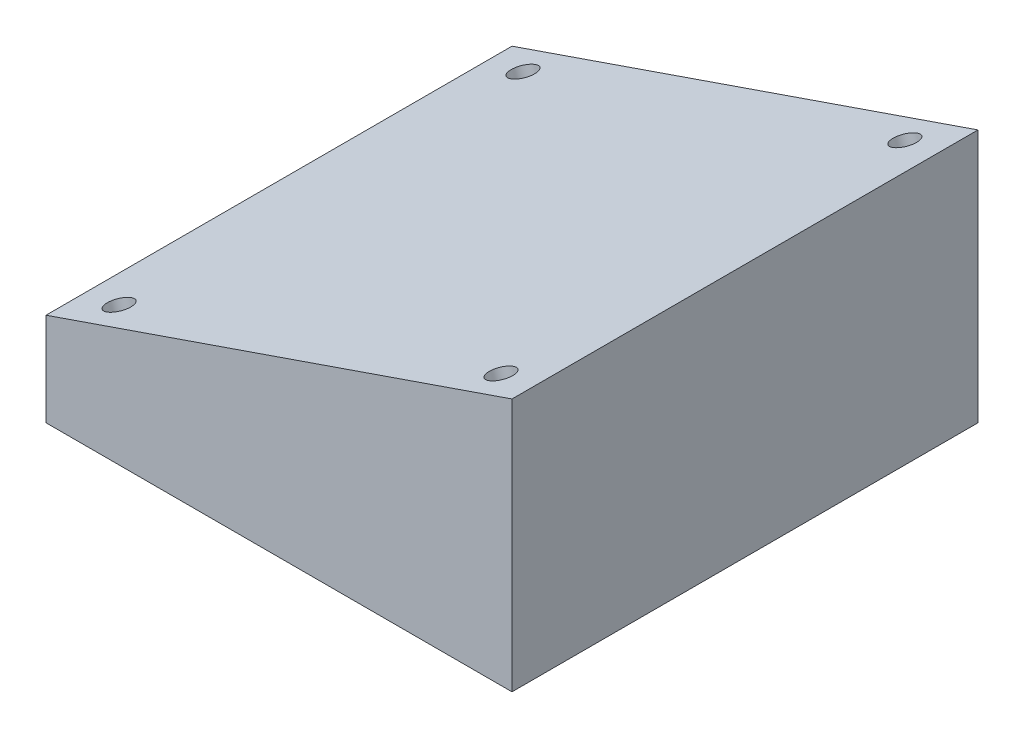
ISO-10303-21;
HEADER;
FILE_DESCRIPTION(('STEP AP214'),'2;1');
FILE_NAME('part.step','',(''),(''),'','','');
FILE_SCHEMA(('AUTOMOTIVE_DESIGN { 1 0 10303 214 1 1 1 1 }'));
ENDSEC;
DATA;
#1=APPLICATION_CONTEXT('core data for automotive mechanical design processes');
#2=APPLICATION_PROTOCOL_DEFINITION('international standard','automotive_design',2000,#1);
#3=PRODUCT_CONTEXT('',#1,'mechanical');
#4=PRODUCT('Part','Part','',(#3));
#5=PRODUCT_RELATED_PRODUCT_CATEGORY('part','',(#4));
#6=PRODUCT_DEFINITION_FORMATION('','',#4);
#7=PRODUCT_DEFINITION_CONTEXT('part definition',#1,'design');
#8=PRODUCT_DEFINITION('design','',#6,#7);
#9=PRODUCT_DEFINITION_SHAPE('','',#8);
#10=(LENGTH_UNIT() NAMED_UNIT(*) SI_UNIT(.MILLI.,.METRE.));
#11=(NAMED_UNIT(*) PLANE_ANGLE_UNIT() SI_UNIT($,.RADIAN.));
#12=(NAMED_UNIT(*) SI_UNIT($,.STERADIAN.) SOLID_ANGLE_UNIT());
#13=UNCERTAINTY_MEASURE_WITH_UNIT(LENGTH_MEASURE(1.E-05),#10,'distance_accuracy_value','');
#14=(GEOMETRIC_REPRESENTATION_CONTEXT(3) GLOBAL_UNCERTAINTY_ASSIGNED_CONTEXT((#13)) GLOBAL_UNIT_ASSIGNED_CONTEXT((#10,
#11,#12)) REPRESENTATION_CONTEXT('',''));
#15=CARTESIAN_POINT('',(0.,0.,0.));
#16=DIRECTION('',(0.,0.,1.));
#17=DIRECTION('',(1.,0.,0.));
#18=AXIS2_PLACEMENT_3D('',#15,#16,#17);
#19=CARTESIAN_POINT('',(150.,60.,150.));
#20=DIRECTION('',(-1.,0.,0.));
#21=DIRECTION('',(0.,0.,1.));
#22=AXIS2_PLACEMENT_3D('',#19,#20,#21);
#23=PLANE('',#22);
#24=DIRECTION('',(0.,0.,-1.));
#25=VECTOR('',#24,1.);
#26=CARTESIAN_POINT('',(150.,0.,150.));
#27=LINE('',#26,#25);
#28=CARTESIAN_POINT('',(150.,0.,150.));
#29=VERTEX_POINT('',#28);
#30=CARTESIAN_POINT('',(150.,0.,-150.));
#31=VERTEX_POINT('',#30);
#32=EDGE_CURVE('E88',#29,#31,#27,.T.);
#33=ORIENTED_EDGE('',*,*,#32,.T.);
#34=DIRECTION('',(0.,-1.,0.));
#35=VECTOR('',#34,1.);
#36=CARTESIAN_POINT('',(150.,60.,-150.));
#37=LINE('',#36,#35);
#38=CARTESIAN_POINT('',(150.,163.2982839869,-150.));
#39=VERTEX_POINT('',#38);
#40=EDGE_CURVE('E11',#39,#31,#37,.T.);
#41=ORIENTED_EDGE('',*,*,#40,.F.);
#42=DIRECTION('',(0.,0.,-1.));
#43=VECTOR('',#42,1.);
#44=CARTESIAN_POINT('',(150.,163.2982839869,467.286204356001));
#45=LINE('',#44,#43);
#46=CARTESIAN_POINT('',(150.,163.2982839869,150.));
#47=VERTEX_POINT('',#46);
#48=EDGE_CURVE('E90',#47,#39,#45,.T.);
#49=ORIENTED_EDGE('',*,*,#48,.F.);
#50=DIRECTION('',(0.,-1.,0.));
#51=VECTOR('',#50,1.);
#52=CARTESIAN_POINT('',(150.,60.,150.));
#53=LINE('',#52,#51);
#54=EDGE_CURVE('E79',#47,#29,#53,.T.);
#55=ORIENTED_EDGE('',*,*,#54,.T.);
#56=EDGE_LOOP('',(#33,#41,#49,#55));
#57=FACE_BOUND('',#56,.T.);
#58=ADVANCED_FACE('F39',(#57),#23,.F.);
#59=CARTESIAN_POINT('',(-150.,60.,-150.));
#60=DIRECTION('',(0.,0.,1.));
#61=DIRECTION('',(1.,0.,0.));
#62=AXIS2_PLACEMENT_3D('',#59,#60,#61);
#63=PLANE('',#62);
#64=DIRECTION('',(-1.,0.,0.));
#65=VECTOR('',#64,1.);
#66=CARTESIAN_POINT('',(-150.,0.,-150.));
#67=LINE('',#66,#65);
#68=CARTESIAN_POINT('',(-150.,0.,-150.));
#69=VERTEX_POINT('',#68);
#70=EDGE_CURVE('E94',#31,#69,#67,.T.);
#71=ORIENTED_EDGE('',*,*,#70,.T.);
#72=DIRECTION('',(0.,-1.,0.));
#73=VECTOR('',#72,1.);
#74=CARTESIAN_POINT('',(-150.,60.,-150.));
#75=LINE('',#74,#73);
#76=CARTESIAN_POINT('',(-150.,60.,-150.));
#77=VERTEX_POINT('',#76);
#78=EDGE_CURVE('E47',#77,#69,#75,.T.);
#79=ORIENTED_EDGE('',*,*,#78,.F.);
#80=DIRECTION('',(0.945518575599317,0.325568154457158,0.));
#81=VECTOR('',#80,1.);
#82=CARTESIAN_POINT('',(-150.,60.,-150.));
#83=LINE('',#82,#81);
#84=EDGE_CURVE('E111',#77,#39,#83,.T.);
#85=ORIENTED_EDGE('',*,*,#84,.T.);
#86=ORIENTED_EDGE('',*,*,#40,.T.);
#87=EDGE_LOOP('',(#71,#79,#85,#86));
#88=FACE_BOUND('',#87,.T.);
#89=ADVANCED_FACE('F109',(#88),#63,.F.);
#90=CARTESIAN_POINT('',(-150.,60.,150.));
#91=DIRECTION('',(1.,0.,0.));
#92=DIRECTION('',(0.,0.,-1.));
#93=AXIS2_PLACEMENT_3D('',#90,#91,#92);
#94=PLANE('',#93);
#95=DIRECTION('',(0.,0.,1.));
#96=VECTOR('',#95,1.);
#97=CARTESIAN_POINT('',(-150.,0.,150.));
#98=LINE('',#97,#96);
#99=CARTESIAN_POINT('',(-150.,0.,150.));
#100=VERTEX_POINT('',#99);
#101=EDGE_CURVE('E70',#69,#100,#98,.T.);
#102=ORIENTED_EDGE('',*,*,#101,.T.);
#103=DIRECTION('',(0.,-1.,0.));
#104=VECTOR('',#103,1.);
#105=CARTESIAN_POINT('',(-150.,60.,150.));
#106=LINE('',#105,#104);
#107=CARTESIAN_POINT('',(-150.,60.,150.));
#108=VERTEX_POINT('',#107);
#109=EDGE_CURVE('E55',#108,#100,#106,.T.);
#110=ORIENTED_EDGE('',*,*,#109,.F.);
#111=DIRECTION('',(0.,0.,1.));
#112=VECTOR('',#111,1.);
#113=CARTESIAN_POINT('',(-150.,60.,150.));
#114=LINE('',#113,#112);
#115=EDGE_CURVE('E83',#77,#108,#114,.T.);
#116=ORIENTED_EDGE('',*,*,#115,.F.);
#117=ORIENTED_EDGE('',*,*,#78,.T.);
#118=EDGE_LOOP('',(#102,#110,#116,#117));
#119=FACE_BOUND('',#118,.T.);
#120=ADVANCED_FACE('F104',(#119),#94,.F.);
#121=CARTESIAN_POINT('',(-150.,60.,150.));
#122=DIRECTION('',(0.,0.,-1.));
#123=DIRECTION('',(-1.,0.,0.));
#124=AXIS2_PLACEMENT_3D('',#121,#122,#123);
#125=PLANE('',#124);
#126=DIRECTION('',(1.,0.,0.));
#127=VECTOR('',#126,1.);
#128=CARTESIAN_POINT('',(-150.,0.,150.));
#129=LINE('',#128,#127);
#130=EDGE_CURVE('E75',#100,#29,#129,.T.);
#131=ORIENTED_EDGE('',*,*,#130,.T.);
#132=ORIENTED_EDGE('',*,*,#54,.F.);
#133=DIRECTION('',(0.945518575599317,0.325568154457158,0.));
#134=VECTOR('',#133,1.);
#135=CARTESIAN_POINT('',(-150.,60.,150.));
#136=LINE('',#135,#134);
#137=EDGE_CURVE('E116',#108,#47,#136,.T.);
#138=ORIENTED_EDGE('',*,*,#137,.F.);
#139=ORIENTED_EDGE('',*,*,#109,.T.);
#140=EDGE_LOOP('',(#131,#132,#138,#139));
#141=FACE_BOUND('',#140,.T.);
#142=ADVANCED_FACE('F77',(#141),#125,.F.);
#143=CARTESIAN_POINT('',(0.,0.,0.));
#144=DIRECTION('',(0.,-1.,0.));
#145=DIRECTION('',(0.,0.,-1.));
#146=AXIS2_PLACEMENT_3D('',#143,#144,#145);
#147=PLANE('',#146);
#148=CARTESIAN_POINT('',(-55.,0.,71.));
#149=DIRECTION('',(0.,-1.,0.));
#150=DIRECTION('',(0.,0.,-1.));
#151=AXIS2_PLACEMENT_3D('',#148,#149,#150);
#152=CIRCLE('',#151,7.);
#153=CARTESIAN_POINT('',(-55.,0.,64.));
#154=VERTEX_POINT('',#153);
#155=EDGE_CURVE('E118',#154,#154,#152,.T.);
#156=ORIENTED_EDGE('',*,*,#155,.F.);
#157=EDGE_LOOP('',(#156));
#158=FACE_BOUND('',#157,.T.);
#159=CARTESIAN_POINT('',(55.,0.,71.));
#160=DIRECTION('',(0.,-1.,0.));
#161=DIRECTION('',(0.,0.,-1.));
#162=AXIS2_PLACEMENT_3D('',#159,#160,#161);
#163=CIRCLE('',#162,7.);
#164=CARTESIAN_POINT('',(55.,0.,64.));
#165=VERTEX_POINT('',#164);
#166=EDGE_CURVE('E129',#165,#165,#163,.T.);
#167=ORIENTED_EDGE('',*,*,#166,.F.);
#168=EDGE_LOOP('',(#167));
#169=FACE_BOUND('',#168,.T.);
#170=CARTESIAN_POINT('',(55.,0.,-71.));
#171=DIRECTION('',(0.,-1.,0.));
#172=DIRECTION('',(0.,0.,-1.));
#173=AXIS2_PLACEMENT_3D('',#170,#171,#172);
#174=CIRCLE('',#173,7.);
#175=CARTESIAN_POINT('',(55.,0.,-78.));
#176=VERTEX_POINT('',#175);
#177=EDGE_CURVE('E135',#176,#176,#174,.T.);
#178=ORIENTED_EDGE('',*,*,#177,.F.);
#179=EDGE_LOOP('',(#178));
#180=FACE_BOUND('',#179,.T.);
#181=CARTESIAN_POINT('',(-55.,0.,-71.));
#182=DIRECTION('',(0.,-1.,0.));
#183=DIRECTION('',(0.,0.,-1.));
#184=AXIS2_PLACEMENT_3D('',#181,#182,#183);
#185=CIRCLE('',#184,7.);
#186=CARTESIAN_POINT('',(-55.,0.,-78.));
#187=VERTEX_POINT('',#186);
#188=EDGE_CURVE('E99',#187,#187,#185,.T.);
#189=ORIENTED_EDGE('',*,*,#188,.F.);
#190=EDGE_LOOP('',(#189));
#191=FACE_BOUND('',#190,.T.);
#192=ORIENTED_EDGE('',*,*,#32,.F.);
#193=ORIENTED_EDGE('',*,*,#130,.F.);
#194=ORIENTED_EDGE('',*,*,#101,.F.);
#195=ORIENTED_EDGE('',*,*,#70,.F.);
#196=EDGE_LOOP('',(#192,#193,#194,#195));
#197=FACE_BOUND('',#196,.T.);
#198=ADVANCED_FACE('F93',(#158,#169,#180,#191,#197),#147,.T.);
#199=CARTESIAN_POINT('',(-55.,10.,-71.));
#200=DIRECTION('',(0.,-1.,0.));
#201=DIRECTION('',(0.,0.,-1.));
#202=AXIS2_PLACEMENT_3D('',#199,#200,#201);
#203=CONICAL_SURFACE('',#202,7.,1.02974425867665);
#204=CARTESIAN_POINT('',(-55.,14.2060243331929,-71.));
#205=VERTEX_POINT('',#204);
#206=VERTEX_LOOP('',#205);
#207=FACE_BOUND('',#206,.T.);
#208=CARTESIAN_POINT('',(-55.,10.,-71.));
#209=DIRECTION('',(0.,-1.,0.));
#210=DIRECTION('',(0.,0.,-1.));
#211=AXIS2_PLACEMENT_3D('',#208,#209,#210);
#212=CIRCLE('',#211,7.);
#213=CARTESIAN_POINT('',(-55.,10.,-78.));
#214=VERTEX_POINT('',#213);
#215=EDGE_CURVE('E95',#214,#214,#212,.T.);
#216=ORIENTED_EDGE('',*,*,#215,.T.);
#217=EDGE_LOOP('',(#216));
#218=FACE_BOUND('',#217,.T.);
#219=ADVANCED_FACE('F147',(#207,#218),#203,.F.);
#220=CARTESIAN_POINT('',(-55.,0.,-71.));
#221=DIRECTION('',(0.,-1.,0.));
#222=DIRECTION('',(0.,0.,-1.));
#223=AXIS2_PLACEMENT_3D('',#220,#221,#222);
#224=CYLINDRICAL_SURFACE('',#223,7.);
#225=ORIENTED_EDGE('',*,*,#215,.F.);
#226=EDGE_LOOP('',(#225));
#227=FACE_BOUND('',#226,.T.);
#228=ORIENTED_EDGE('',*,*,#188,.T.);
#229=EDGE_LOOP('',(#228));
#230=FACE_BOUND('',#229,.T.);
#231=ADVANCED_FACE('F144',(#227,#230),#224,.F.);
#232=CARTESIAN_POINT('',(55.,10.,-71.));
#233=DIRECTION('',(0.,-1.,0.));
#234=DIRECTION('',(0.,0.,-1.));
#235=AXIS2_PLACEMENT_3D('',#232,#233,#234);
#236=CONICAL_SURFACE('',#235,7.,1.02974425867665);
#237=CARTESIAN_POINT('',(55.,14.2060243331929,-71.));
#238=VERTEX_POINT('',#237);
#239=VERTEX_LOOP('',#238);
#240=FACE_BOUND('',#239,.T.);
#241=CARTESIAN_POINT('',(55.,10.,-71.));
#242=DIRECTION('',(0.,-1.,0.));
#243=DIRECTION('',(0.,0.,-1.));
#244=AXIS2_PLACEMENT_3D('',#241,#242,#243);
#245=CIRCLE('',#244,7.);
#246=CARTESIAN_POINT('',(55.,10.,-78.));
#247=VERTEX_POINT('',#246);
#248=EDGE_CURVE('E138',#247,#247,#245,.T.);
#249=ORIENTED_EDGE('',*,*,#248,.T.);
#250=EDGE_LOOP('',(#249));
#251=FACE_BOUND('',#250,.T.);
#252=ADVANCED_FACE('F281',(#240,#251),#236,.F.);
#253=CARTESIAN_POINT('',(55.,0.,-71.));
#254=DIRECTION('',(0.,-1.,0.));
#255=DIRECTION('',(0.,0.,-1.));
#256=AXIS2_PLACEMENT_3D('',#253,#254,#255);
#257=CYLINDRICAL_SURFACE('',#256,7.);
#258=ORIENTED_EDGE('',*,*,#248,.F.);
#259=EDGE_LOOP('',(#258));
#260=FACE_BOUND('',#259,.T.);
#261=ORIENTED_EDGE('',*,*,#177,.T.);
#262=EDGE_LOOP('',(#261));
#263=FACE_BOUND('',#262,.T.);
#264=ADVANCED_FACE('F290',(#260,#263),#257,.F.);
#265=CARTESIAN_POINT('',(55.,10.,71.));
#266=DIRECTION('',(0.,-1.,0.));
#267=DIRECTION('',(0.,0.,-1.));
#268=AXIS2_PLACEMENT_3D('',#265,#266,#267);
#269=CONICAL_SURFACE('',#268,7.,1.02974425867665);
#270=CARTESIAN_POINT('',(55.,14.2060243331929,71.));
#271=VERTEX_POINT('',#270);
#272=VERTEX_LOOP('',#271);
#273=FACE_BOUND('',#272,.T.);
#274=CARTESIAN_POINT('',(55.,10.,71.));
#275=DIRECTION('',(0.,-1.,0.));
#276=DIRECTION('',(0.,0.,-1.));
#277=AXIS2_PLACEMENT_3D('',#274,#275,#276);
#278=CIRCLE('',#277,7.);
#279=CARTESIAN_POINT('',(55.,10.,64.));
#280=VERTEX_POINT('',#279);
#281=EDGE_CURVE('E132',#280,#280,#278,.T.);
#282=ORIENTED_EDGE('',*,*,#281,.T.);
#283=EDGE_LOOP('',(#282));
#284=FACE_BOUND('',#283,.T.);
#285=ADVANCED_FACE('F295',(#273,#284),#269,.F.);
#286=CARTESIAN_POINT('',(55.,0.,71.));
#287=DIRECTION('',(0.,-1.,0.));
#288=DIRECTION('',(0.,0.,-1.));
#289=AXIS2_PLACEMENT_3D('',#286,#287,#288);
#290=CYLINDRICAL_SURFACE('',#289,7.);
#291=ORIENTED_EDGE('',*,*,#281,.F.);
#292=EDGE_LOOP('',(#291));
#293=FACE_BOUND('',#292,.T.);
#294=ORIENTED_EDGE('',*,*,#166,.T.);
#295=EDGE_LOOP('',(#294));
#296=FACE_BOUND('',#295,.T.);
#297=ADVANCED_FACE('F303',(#293,#296),#290,.F.);
#298=CARTESIAN_POINT('',(-55.,10.,71.));
#299=DIRECTION('',(0.,-1.,0.));
#300=DIRECTION('',(0.,0.,-1.));
#301=AXIS2_PLACEMENT_3D('',#298,#299,#300);
#302=CONICAL_SURFACE('',#301,7.,1.02974425867665);
#303=CARTESIAN_POINT('',(-55.,14.2060243331929,71.));
#304=VERTEX_POINT('',#303);
#305=VERTEX_LOOP('',#304);
#306=FACE_BOUND('',#305,.T.);
#307=CARTESIAN_POINT('',(-55.,10.,71.));
#308=DIRECTION('',(0.,-1.,0.));
#309=DIRECTION('',(0.,0.,-1.));
#310=AXIS2_PLACEMENT_3D('',#307,#308,#309);
#311=CIRCLE('',#310,7.);
#312=CARTESIAN_POINT('',(-55.,10.,64.));
#313=VERTEX_POINT('',#312);
#314=EDGE_CURVE('E126',#313,#313,#311,.T.);
#315=ORIENTED_EDGE('',*,*,#314,.T.);
#316=EDGE_LOOP('',(#315));
#317=FACE_BOUND('',#316,.T.);
#318=ADVANCED_FACE('F308',(#306,#317),#302,.F.);
#319=CARTESIAN_POINT('',(-55.,0.,71.));
#320=DIRECTION('',(0.,-1.,0.));
#321=DIRECTION('',(0.,0.,-1.));
#322=AXIS2_PLACEMENT_3D('',#319,#320,#321);
#323=CYLINDRICAL_SURFACE('',#322,7.);
#324=ORIENTED_EDGE('',*,*,#314,.F.);
#325=EDGE_LOOP('',(#324));
#326=FACE_BOUND('',#325,.T.);
#327=ORIENTED_EDGE('',*,*,#155,.T.);
#328=EDGE_LOOP('',(#327));
#329=FACE_BOUND('',#328,.T.);
#330=ADVANCED_FACE('F185',(#326,#329),#323,.F.);
#331=CARTESIAN_POINT('',(-150.,60.,467.286204356001));
#332=DIRECTION('',(0.325568154457158,-0.945518575599317,0.));
#333=DIRECTION('',(0.945518575599317,0.325568154457158,0.));
#334=AXIS2_PLACEMENT_3D('',#331,#332,#333);
#335=PLANE('',#334);
#336=CARTESIAN_POINT('',(-122.917414827911,69.3252819140195,-130.));
#337=DIRECTION('',(-0.325568154457158,0.945518575599316,0.));
#338=DIRECTION('',(-0.945518575599317,-0.325568154457158,0.));
#339=AXIS2_PLACEMENT_3D('',#336,#337,#338);
#340=CIRCLE('',#339,7.99999999999998);
#341=CARTESIAN_POINT('',(-130.481563432706,66.7207366783622,-130.));
#342=VERTEX_POINT('',#341);
#343=EDGE_CURVE('E417',#342,#342,#340,.T.);
#344=ORIENTED_EDGE('',*,*,#343,.F.);
#345=EDGE_LOOP('',(#344));
#346=FACE_BOUND('',#345,.T.);
#347=CARTESIAN_POINT('',(122.917414827911,153.97300207288,-130.));
#348=DIRECTION('',(-0.325568154457158,0.945518575599316,0.));
#349=DIRECTION('',(-0.945518575599317,-0.325568154457158,0.));
#350=AXIS2_PLACEMENT_3D('',#347,#348,#349);
#351=CIRCLE('',#350,7.99999999999998);
#352=CARTESIAN_POINT('',(115.353266223117,151.368456837223,-130.));
#353=VERTEX_POINT('',#352);
#354=EDGE_CURVE('E416',#353,#353,#351,.T.);
#355=ORIENTED_EDGE('',*,*,#354,.F.);
#356=EDGE_LOOP('',(#355));
#357=FACE_BOUND('',#356,.T.);
#358=CARTESIAN_POINT('',(122.917414827911,153.97300207288,130.));
#359=DIRECTION('',(-0.325568154457158,0.945518575599316,0.));
#360=DIRECTION('',(-0.945518575599317,-0.325568154457158,0.));
#361=AXIS2_PLACEMENT_3D('',#358,#359,#360);
#362=CIRCLE('',#361,7.99999999999998);
#363=CARTESIAN_POINT('',(115.353266223117,151.368456837223,130.));
#364=VERTEX_POINT('',#363);
#365=EDGE_CURVE('E427',#364,#364,#362,.T.);
#366=ORIENTED_EDGE('',*,*,#365,.F.);
#367=EDGE_LOOP('',(#366));
#368=FACE_BOUND('',#367,.T.);
#369=CARTESIAN_POINT('',(-122.917414827911,69.3252819140195,130.));
#370=DIRECTION('',(-0.325568154457158,0.945518575599316,0.));
#371=DIRECTION('',(-0.945518575599317,-0.325568154457158,0.));
#372=AXIS2_PLACEMENT_3D('',#369,#370,#371);
#373=CIRCLE('',#372,7.99999999999998);
#374=CARTESIAN_POINT('',(-130.481563432706,66.7207366783622,130.));
#375=VERTEX_POINT('',#374);
#376=EDGE_CURVE('E433',#375,#375,#373,.T.);
#377=ORIENTED_EDGE('',*,*,#376,.F.);
#378=EDGE_LOOP('',(#377));
#379=FACE_BOUND('',#378,.T.);
#380=ORIENTED_EDGE('',*,*,#115,.T.);
#381=ORIENTED_EDGE('',*,*,#137,.T.);
#382=ORIENTED_EDGE('',*,*,#48,.T.);
#383=ORIENTED_EDGE('',*,*,#84,.F.);
#384=EDGE_LOOP('',(#380,#381,#382,#383));
#385=FACE_BOUND('',#384,.T.);
#386=ADVANCED_FACE('F115',(#346,#357,#368,#379,#385),#335,.F.);
#387=CARTESIAN_POINT('',(-117.057188047682,52.3059475532318,130.));
#388=DIRECTION('',(-0.325568154457158,0.945518575599316,0.));
#389=DIRECTION('',(-0.945518575599317,-0.325568154457158,0.));
#390=AXIS2_PLACEMENT_3D('',#387,#388,#389);
#391=CONICAL_SURFACE('',#390,7.99999999999998,1.02974425867665);
#392=CARTESIAN_POINT('',(-115.4922193851,47.7609485401385,130.));
#393=VERTEX_POINT('',#392);
#394=VERTEX_LOOP('',#393);
#395=FACE_BOUND('',#394,.T.);
#396=CARTESIAN_POINT('',(-117.057188047682,52.3059475532318,130.));
#397=DIRECTION('',(-0.325568154457158,0.945518575599316,0.));
#398=DIRECTION('',(-0.945518575599317,-0.325568154457158,0.));
#399=AXIS2_PLACEMENT_3D('',#396,#397,#398);
#400=CIRCLE('',#399,7.99999999999998);
#401=CARTESIAN_POINT('',(-124.621336652477,49.7014023175745,130.));
#402=VERTEX_POINT('',#401);
#403=EDGE_CURVE('E120',#402,#402,#400,.T.);
#404=ORIENTED_EDGE('',*,*,#403,.T.);
#405=EDGE_LOOP('',(#404));
#406=FACE_BOUND('',#405,.T.);
#407=ADVANCED_FACE('F184',(#395,#406),#391,.F.);
#408=CARTESIAN_POINT('',(-122.917414827911,69.3252819140195,130.));
#409=DIRECTION('',(-0.325568154457158,0.945518575599316,0.));
#410=DIRECTION('',(-0.945518575599317,-0.325568154457158,0.));
#411=AXIS2_PLACEMENT_3D('',#408,#409,#410);
#412=CYLINDRICAL_SURFACE('',#411,7.99999999999998);
#413=ORIENTED_EDGE('',*,*,#403,.F.);
#414=EDGE_LOOP('',(#413));
#415=FACE_BOUND('',#414,.T.);
#416=ORIENTED_EDGE('',*,*,#376,.T.);
#417=EDGE_LOOP('',(#416));
#418=FACE_BOUND('',#417,.T.);
#419=ADVANCED_FACE('F196',(#415,#418),#412,.F.);
#420=CARTESIAN_POINT('',(128.77764160814,136.953667712093,130.));
#421=DIRECTION('',(-0.325568154457158,0.945518575599316,0.));
#422=DIRECTION('',(-0.945518575599317,-0.325568154457158,0.));
#423=AXIS2_PLACEMENT_3D('',#420,#421,#422);
#424=CONICAL_SURFACE('',#423,7.99999999999998,1.02974425867665);
#425=CARTESIAN_POINT('',(130.342610270722,132.408668698999,130.));
#426=VERTEX_POINT('',#425);
#427=VERTEX_LOOP('',#426);
#428=FACE_BOUND('',#427,.T.);
#429=CARTESIAN_POINT('',(128.77764160814,136.953667712093,130.));
#430=DIRECTION('',(-0.325568154457158,0.945518575599316,0.));
#431=DIRECTION('',(-0.945518575599317,-0.325568154457158,0.));
#432=AXIS2_PLACEMENT_3D('',#429,#430,#431);
#433=CIRCLE('',#432,7.99999999999998);
#434=CARTESIAN_POINT('',(121.213493003345,134.349122476436,130.));
#435=VERTEX_POINT('',#434);
#436=EDGE_CURVE('E430',#435,#435,#433,.T.);
#437=ORIENTED_EDGE('',*,*,#436,.T.);
#438=EDGE_LOOP('',(#437));
#439=FACE_BOUND('',#438,.T.);
#440=ADVANCED_FACE('F207',(#428,#439),#424,.F.);
#441=CARTESIAN_POINT('',(122.917414827911,153.97300207288,130.));
#442=DIRECTION('',(-0.325568154457158,0.945518575599316,0.));
#443=DIRECTION('',(-0.945518575599317,-0.325568154457158,0.));
#444=AXIS2_PLACEMENT_3D('',#441,#442,#443);
#445=CYLINDRICAL_SURFACE('',#444,7.99999999999998);
#446=ORIENTED_EDGE('',*,*,#436,.F.);
#447=EDGE_LOOP('',(#446));
#448=FACE_BOUND('',#447,.T.);
#449=ORIENTED_EDGE('',*,*,#365,.T.);
#450=EDGE_LOOP('',(#449));
#451=FACE_BOUND('',#450,.T.);
#452=ADVANCED_FACE('F218',(#448,#451),#445,.F.);
#453=CARTESIAN_POINT('',(128.77764160814,136.953667712093,-130.));
#454=DIRECTION('',(-0.325568154457158,0.945518575599316,0.));
#455=DIRECTION('',(-0.945518575599317,-0.325568154457158,0.));
#456=AXIS2_PLACEMENT_3D('',#453,#454,#455);
#457=CONICAL_SURFACE('',#456,7.99999999999998,1.02974425867665);
#458=CARTESIAN_POINT('',(130.342610270722,132.408668698999,-130.));
#459=VERTEX_POINT('',#458);
#460=VERTEX_LOOP('',#459);
#461=FACE_BOUND('',#460,.T.);
#462=CARTESIAN_POINT('',(128.77764160814,136.953667712093,-130.));
#463=DIRECTION('',(-0.325568154457158,0.945518575599316,0.));
#464=DIRECTION('',(-0.945518575599317,-0.325568154457158,0.));
#465=AXIS2_PLACEMENT_3D('',#462,#463,#464);
#466=CIRCLE('',#465,7.99999999999998);
#467=CARTESIAN_POINT('',(121.213493003345,134.349122476435,-130.));
#468=VERTEX_POINT('',#467);
#469=EDGE_CURVE('E420',#468,#468,#466,.T.);
#470=ORIENTED_EDGE('',*,*,#469,.T.);
#471=EDGE_LOOP('',(#470));
#472=FACE_BOUND('',#471,.T.);
#473=ADVANCED_FACE('F228',(#461,#472),#457,.F.);
#474=CARTESIAN_POINT('',(122.917414827911,153.97300207288,-130.));
#475=DIRECTION('',(-0.325568154457158,0.945518575599316,0.));
#476=DIRECTION('',(-0.945518575599317,-0.325568154457158,0.));
#477=AXIS2_PLACEMENT_3D('',#474,#475,#476);
#478=CYLINDRICAL_SURFACE('',#477,7.99999999999998);
#479=ORIENTED_EDGE('',*,*,#469,.F.);
#480=EDGE_LOOP('',(#479));
#481=FACE_BOUND('',#480,.T.);
#482=ORIENTED_EDGE('',*,*,#354,.T.);
#483=EDGE_LOOP('',(#482));
#484=FACE_BOUND('',#483,.T.);
#485=ADVANCED_FACE('F239',(#481,#484),#478,.F.);
#486=CARTESIAN_POINT('',(-117.057188047682,52.3059475532318,-130.));
#487=DIRECTION('',(-0.325568154457158,0.945518575599316,0.));
#488=DIRECTION('',(-0.945518575599317,-0.325568154457158,0.));
#489=AXIS2_PLACEMENT_3D('',#486,#487,#488);
#490=CONICAL_SURFACE('',#489,7.99999999999998,1.02974425867665);
#491=CARTESIAN_POINT('',(-115.4922193851,47.7609485401385,-130.));
#492=VERTEX_POINT('',#491);
#493=VERTEX_LOOP('',#492);
#494=FACE_BOUND('',#493,.T.);
#495=CARTESIAN_POINT('',(-117.057188047682,52.3059475532318,-130.));
#496=DIRECTION('',(-0.325568154457158,0.945518575599316,0.));
#497=DIRECTION('',(-0.945518575599317,-0.325568154457158,0.));
#498=AXIS2_PLACEMENT_3D('',#495,#496,#497);
#499=CIRCLE('',#498,7.99999999999998);
#500=CARTESIAN_POINT('',(-124.621336652477,49.7014023175745,-130.));
#501=VERTEX_POINT('',#500);
#502=EDGE_CURVE('E415',#501,#501,#499,.T.);
#503=ORIENTED_EDGE('',*,*,#502,.T.);
#504=EDGE_LOOP('',(#503));
#505=FACE_BOUND('',#504,.T.);
#506=ADVANCED_FACE('F249',(#494,#505),#490,.F.);
#507=CARTESIAN_POINT('',(-122.917414827911,69.3252819140195,-130.));
#508=DIRECTION('',(-0.325568154457158,0.945518575599316,0.));
#509=DIRECTION('',(-0.945518575599317,-0.325568154457158,0.));
#510=AXIS2_PLACEMENT_3D('',#507,#508,#509);
#511=CYLINDRICAL_SURFACE('',#510,7.99999999999998);
#512=ORIENTED_EDGE('',*,*,#502,.F.);
#513=EDGE_LOOP('',(#512));
#514=FACE_BOUND('',#513,.T.);
#515=ORIENTED_EDGE('',*,*,#343,.T.);
#516=EDGE_LOOP('',(#515));
#517=FACE_BOUND('',#516,.T.);
#518=ADVANCED_FACE('F260',(#514,#517),#511,.F.);
#519=CLOSED_SHELL('',(#58,#89,#120,#142,#198,#219,#231,#252,#264,#285,#297,#318,#330,#386,#407,
#419,#440,#452,#473,#485,#506,#518));
#520=MANIFOLD_SOLID_BREP('B2',#519);
#521=ADVANCED_BREP_SHAPE_REPRESENTATION('',(#18,#520),#14);
#522=SHAPE_DEFINITION_REPRESENTATION(#9,#521);
ENDSEC;
END-ISO-10303-21;
